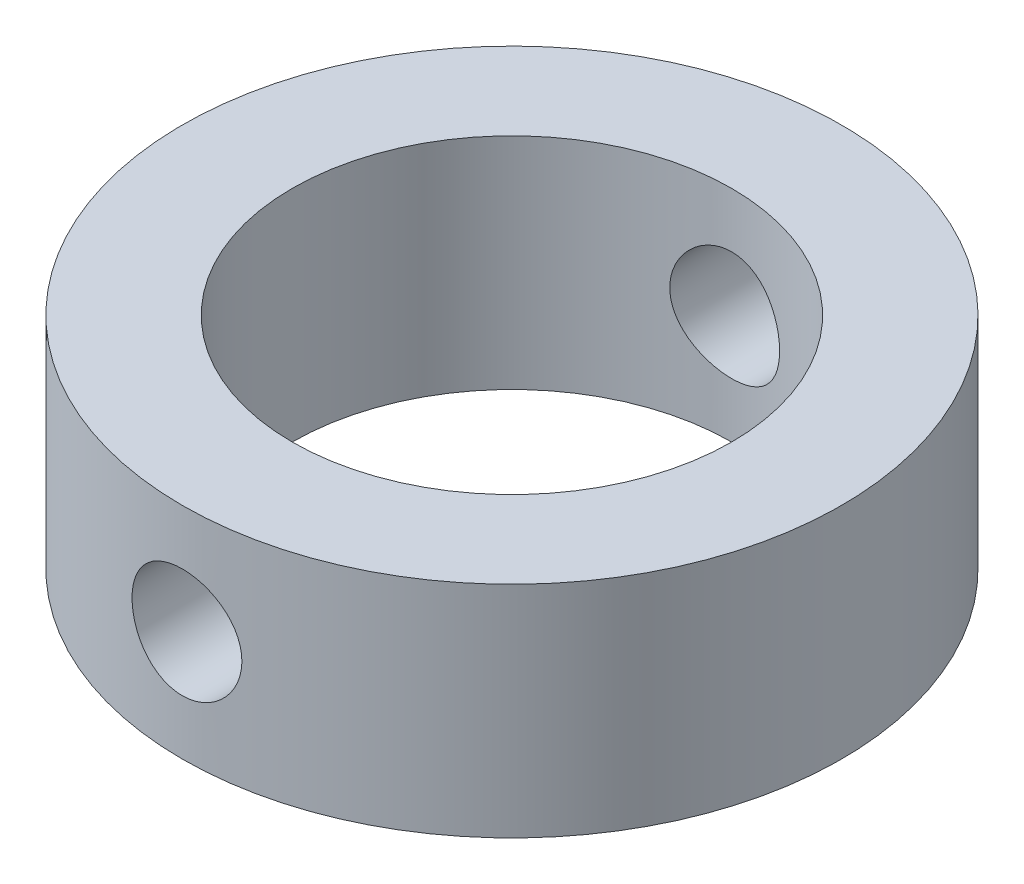
ISO-10303-21;
HEADER;
FILE_DESCRIPTION(('STEP AP214'),'2;1');
FILE_NAME('part.step','',(''),(''),'','','');
FILE_SCHEMA(('AUTOMOTIVE_DESIGN { 1 0 10303 214 1 1 1 1 }'));
ENDSEC;
DATA;
#1=APPLICATION_CONTEXT('core data for automotive mechanical design processes');
#2=APPLICATION_PROTOCOL_DEFINITION('international standard','automotive_design',2000,#1);
#3=PRODUCT_CONTEXT('',#1,'mechanical');
#4=PRODUCT('Part','Part','',(#3));
#5=PRODUCT_RELATED_PRODUCT_CATEGORY('part','',(#4));
#6=PRODUCT_DEFINITION_FORMATION('','',#4);
#7=PRODUCT_DEFINITION_CONTEXT('part definition',#1,'design');
#8=PRODUCT_DEFINITION('design','',#6,#7);
#9=PRODUCT_DEFINITION_SHAPE('','',#8);
#10=(LENGTH_UNIT() NAMED_UNIT(*) SI_UNIT(.MILLI.,.METRE.));
#11=(NAMED_UNIT(*) PLANE_ANGLE_UNIT() SI_UNIT($,.RADIAN.));
#12=(NAMED_UNIT(*) SI_UNIT($,.STERADIAN.) SOLID_ANGLE_UNIT());
#13=UNCERTAINTY_MEASURE_WITH_UNIT(LENGTH_MEASURE(1.E-05),#10,'distance_accuracy_value','');
#14=(GEOMETRIC_REPRESENTATION_CONTEXT(3) GLOBAL_UNCERTAINTY_ASSIGNED_CONTEXT((#13)) GLOBAL_UNIT_ASSIGNED_CONTEXT((#10,
#11,#12)) REPRESENTATION_CONTEXT('',''));
#15=CARTESIAN_POINT('',(0.,0.,0.));
#16=DIRECTION('',(0.,0.,1.));
#17=DIRECTION('',(1.,0.,0.));
#18=AXIS2_PLACEMENT_3D('',#15,#16,#17);
#19=CARTESIAN_POINT('',(0.,8.,0.));
#20=DIRECTION('',(0.,-1.,0.));
#21=DIRECTION('',(0.,0.,-1.));
#22=AXIS2_PLACEMENT_3D('',#19,#20,#21);
#23=CYLINDRICAL_SURFACE('',#22,12.);
#24=CARTESIAN_POINT('',(0.,8.,0.));
#25=DIRECTION('',(0.,1.,0.));
#26=DIRECTION('',(0.,0.,1.));
#27=AXIS2_PLACEMENT_3D('',#24,#25,#26);
#28=CIRCLE('',#27,12.);
#29=CARTESIAN_POINT('',(0.,8.,12.));
#30=VERTEX_POINT('',#29);
#31=EDGE_CURVE('E10',#30,#30,#28,.T.);
#32=ORIENTED_EDGE('',*,*,#31,.F.);
#33=EDGE_LOOP('',(#32));
#34=FACE_BOUND('',#33,.T.);
#35=CARTESIAN_POINT('',(0.,0.,0.));
#36=DIRECTION('',(0.,1.,0.));
#37=DIRECTION('',(0.,0.,1.));
#38=AXIS2_PLACEMENT_3D('',#35,#36,#37);
#39=CIRCLE('',#38,12.);
#40=CARTESIAN_POINT('',(0.,0.,12.));
#41=VERTEX_POINT('',#40);
#42=EDGE_CURVE('E53',#41,#41,#39,.T.);
#43=ORIENTED_EDGE('',*,*,#42,.T.);
#44=EDGE_LOOP('',(#43));
#45=FACE_BOUND('',#44,.T.);
#46=CARTESIAN_POINT('',(-2.,4.,11.8321595661992));
#47=CARTESIAN_POINT('',(-1.99999551873586,3.88849940147055,11.8321615789328));
#48=CARTESIAN_POINT('',(-1.99064413522262,3.77693791514282,11.8337527390819));
#49=CARTESIAN_POINT('',(-1.9535019424531,3.55694516538947,11.8399396576003));
#50=CARTESIAN_POINT('',(-1.92569412824689,3.44851688499355,11.844538186771));
#51=CARTESIAN_POINT('',(-1.8525036349364,3.23800617332671,11.8562048749385));
#52=CARTESIAN_POINT('',(-1.80713564394559,3.1359185210702,11.8632709694721));
#53=CARTESIAN_POINT('',(-1.70014919751157,2.94081523622578,11.8790741768183));
#54=CARTESIAN_POINT('',(-1.63853257080106,2.84779858433813,11.8878111015538));
#55=CARTESIAN_POINT('',(-1.50015002157323,2.67254972020435,11.906067769247));
#56=CARTESIAN_POINT('',(-1.42325523914587,2.59041989489103,11.9155937386236));
#57=CARTESIAN_POINT('',(-1.25677760375622,2.44016535451055,11.9342998453486));
#58=CARTESIAN_POINT('',(-1.16719399931998,2.37204146950767,11.9434799621739));
#59=CARTESIAN_POINT('',(-0.977218295958685,2.25134834622458,11.9605258958617));
#60=CARTESIAN_POINT('',(-0.876764865165367,2.19887439381456,11.9683835394587));
#61=CARTESIAN_POINT('',(-0.668316497379094,2.11158314357556,11.9818298956567));
#62=CARTESIAN_POINT('',(-0.56032205126255,2.0767646976921,11.9874187557813));
#63=CARTESIAN_POINT('',(-0.340914981075393,2.02608597201288,11.9956538777952));
#64=CARTESIAN_POINT('',(-0.229543109343416,2.01005366719625,11.9983268248873));
#65=CARTESIAN_POINT('',(-0.00566022842063738,1.99686739667792,12.0005206347422));
#66=CARTESIAN_POINT('',(0.106850702823119,1.99971214780221,12.0000417117545));
#67=CARTESIAN_POINT('',(0.328641748063101,2.02406508122257,11.9960068674511));
#68=CARTESIAN_POINT('',(0.437942824560113,2.04538813072732,11.9924814695392));
#69=CARTESIAN_POINT('',(0.651393583689433,2.10580085939719,11.9827838301731));
#70=CARTESIAN_POINT('',(0.755543109321203,2.1448910796716,11.9766115081057));
#71=CARTESIAN_POINT('',(0.956284918226118,2.23991251225225,11.9622615880957));
#72=CARTESIAN_POINT('',(1.05284041841524,2.29592000966595,11.954074938615));
#73=CARTESIAN_POINT('',(1.23525242387731,2.42313025810804,11.936605904572));
#74=CARTESIAN_POINT('',(1.3211080623327,2.49433423896865,11.9273234313531));
#75=CARTESIAN_POINT('',(1.48077701875733,2.65094304529545,11.9085621458608));
#76=CARTESIAN_POINT('',(1.55443160180257,2.73650967592079,11.8990823178483));
#77=CARTESIAN_POINT('',(1.68636367075845,2.91886967217266,11.8811036782784));
#78=CARTESIAN_POINT('',(1.74464101482593,3.01566314134626,11.8726048757706));
#79=CARTESIAN_POINT('',(1.84419554759063,3.21791331350198,11.8575500364945));
#80=CARTESIAN_POINT('',(1.88545362182339,3.32337959847367,11.8509961864208));
#81=CARTESIAN_POINT('',(1.94962389665249,3.53987925784604,11.840609509519));
#82=CARTESIAN_POINT('',(1.97253771261436,3.65091214114594,11.8367764431066));
#83=CARTESIAN_POINT('',(1.99914550790341,3.87397292492971,11.8323116753769));
#84=CARTESIAN_POINT('',(2.00306576632995,3.98597310376168,11.8316422860694));
#85=CARTESIAN_POINT('',(1.99217816214597,4.20902933735266,11.8334802782589));
#86=CARTESIAN_POINT('',(1.97737102289973,4.32008542841118,11.8359875370548));
#87=CARTESIAN_POINT('',(1.92964186794248,4.53738220735269,11.8438614996401));
#88=CARTESIAN_POINT('',(1.89683503251711,4.64364891190241,11.8492100153468));
#89=CARTESIAN_POINT('',(1.81415855215382,4.84917613302359,11.862148584044));
#90=CARTESIAN_POINT('',(1.76428788648075,4.94843623004072,11.8697387711246));
#91=CARTESIAN_POINT('',(1.64836533858338,5.13813967552489,11.8863930271791));
#92=CARTESIAN_POINT('',(1.58216845132749,5.22849325820485,11.8954700448028));
#93=CARTESIAN_POINT('',(1.43567157256638,5.396890826156,11.9140373334389));
#94=CARTESIAN_POINT('',(1.35537058910724,5.47493394488779,11.9235276334827));
#95=CARTESIAN_POINT('',(1.18194245626305,5.61732151418296,11.9419713769461));
#96=CARTESIAN_POINT('',(1.08869060270896,5.68151506102763,11.9509182107574));
#97=CARTESIAN_POINT('',(0.892594758359461,5.7933242616039,11.9671608994635));
#98=CARTESIAN_POINT('',(0.789751077976501,5.84094045157908,11.9744568077598));
#99=CARTESIAN_POINT('',(0.577839241201062,5.91800846716389,11.9865468653567));
#100=CARTESIAN_POINT('',(0.468800450082089,5.94753926058794,11.9913518765409));
#101=CARTESIAN_POINT('',(0.247224587899368,5.98785247917106,11.9979646653543));
#102=CARTESIAN_POINT('',(0.134687805457296,5.99863644698588,11.9997726896015));
#103=CARTESIAN_POINT('',(-0.0892330206189422,6.00110550584976,12.0001843031025));
#104=CARTESIAN_POINT('',(-0.200614528482133,5.99302020315287,11.9988264161935));
#105=CARTESIAN_POINT('',(-0.420409579451765,5.95847686218446,11.9931374270987));
#106=CARTESIAN_POINT('',(-0.528823139173985,5.93201892679226,11.9888063415615));
#107=CARTESIAN_POINT('',(-0.73951715673483,5.86156946756508,11.9776559106192));
#108=CARTESIAN_POINT('',(-0.841804297723056,5.81759746543196,11.970839336327));
#109=CARTESIAN_POINT('',(-1.03758436238573,5.71339365101553,11.9554620550242));
#110=CARTESIAN_POINT('',(-1.13107686889458,5.65316106795004,11.9469012653393));
#111=CARTESIAN_POINT('',(-1.30777035642112,5.5173319260316,11.9288610369313));
#112=CARTESIAN_POINT('',(-1.3908411444822,5.44156723619899,11.919372196329));
#113=CARTESIAN_POINT('',(-1.54317110076073,5.27717735367695,11.900610426515));
#114=CARTESIAN_POINT('',(-1.61242702936952,5.18854915286997,11.8913375483961));
#115=CARTESIAN_POINT('',(-1.73561141672869,5.00020374200831,11.8739867482713));
#116=CARTESIAN_POINT('',(-1.78942799124616,4.90041252818761,11.8659177427663));
#117=CARTESIAN_POINT('',(-1.87945162912342,4.69311261132948,11.8519936807305));
#118=CARTESIAN_POINT('',(-1.91567628417846,4.58561174185811,11.846136413799));
#119=CARTESIAN_POINT('',(-1.96162084250194,4.39807698441009,11.8385979588519));
#120=CARTESIAN_POINT('',(-1.97598993413711,4.31917855362991,11.8361969873557));
#121=CARTESIAN_POINT('',(-1.99518103614505,4.16019721213045,11.8329770823046));
#122=CARTESIAN_POINT('',(-2.00000321983422,4.08011432294064,11.8321581200295));
#123=CARTESIAN_POINT('',(-2.,4.,11.8321595661992));
#124=B_SPLINE_CURVE_WITH_KNOTS('',3,(#46,#47,#48,#49,#50,#51,#52,#53,#54,#55,#56,#57,#58,#59,
#60,#61,#62,#63,#64,#65,#66,#67,#68,#69,#70,#71,#72,#73,#74,#75,#76,#77,#78,#79,#80,#81,#82,#83,
#84,#85,#86,#87,#88,#89,#90,#91,#92,#93,#94,#95,#96,#97,#98,#99,#100,#101,#102,#103,#104,#105,
#106,#107,#108,#109,#110,#111,#112,#113,#114,#115,#116,#117,#118,#119,#120,#121,#122,#123),
.UNSPECIFIED.,.T.,.F.,(4,2,2,2,2,2,2,2,2,2,2,2,2,2,2,2,2,2,2,2,2,2,2,2,2,2,2,2,2,2,2,2,2,2,2,2,
2,2,4),(0.,0.334208831142192,0.668726015970376,1.00296399830015,1.33716437924219,
1.67431327324572,2.01148214267558,2.35066384089148,2.6898234808889,3.02585253978052,
3.36185875722154,3.69453696931735,4.02722531399626,4.3614368331154,4.69567540981411,
5.03396898769699,5.37226568596815,5.71094129998883,6.04958708750461,6.38418833936328,
6.71877666731181,7.05124851708393,7.38374025834859,7.71929874210161,8.05488083544551,
8.39395290428305,8.73301400381358,9.07058387534117,9.40812596729881,9.74158221012733,
10.0750365857506,10.4081203186597,10.7412198431387,11.078135979706,11.4151310310545,
11.7545098209466,12.0935485339556,12.3336853643501,12.5738178352145),.UNSPECIFIED.);
#125=CARTESIAN_POINT('',(-2.,4.,11.8321595661992));
#126=VERTEX_POINT('',#125);
#127=EDGE_CURVE('E83',#126,#126,#124,.T.);
#128=ORIENTED_EDGE('',*,*,#127,.F.);
#129=EDGE_LOOP('',(#128));
#130=FACE_BOUND('',#129,.T.);
#131=CARTESIAN_POINT('',(0.,6.,-12.));
#132=CARTESIAN_POINT('',(0.111512723966572,5.99999552884175,-11.9999980893506));
#133=CARTESIAN_POINT('',(0.223086305471057,5.99064218002486,-11.9984294233043));
#134=CARTESIAN_POINT('',(0.443104177338434,5.95349147298774,-11.9923227595311));
#135=CARTESIAN_POINT('',(0.551545494367397,5.92567715447072,-11.9877820313911));
#136=CARTESIAN_POINT('',(0.762083797770115,5.8524676411258,-11.9762405458916));
#137=CARTESIAN_POINT('',(0.86418589474552,5.80708682748754,-11.9692418012735));
#138=CARTESIAN_POINT('',(1.05931347358235,5.70007016635808,-11.9535538166566));
#139=CARTESIAN_POINT('',(1.15233999190287,5.6384361780136,-11.9448647700355));
#140=CARTESIAN_POINT('',(1.32757809143334,5.50003593294363,-11.9266665396665));
#141=CARTESIAN_POINT('',(1.40969032282797,5.4231447082911,-11.9171509745189));
#142=CARTESIAN_POINT('',(1.55991079892794,5.25668162522175,-11.8984210150139));
#143=CARTESIAN_POINT('',(1.62801815951278,5.16710896683471,-11.8892066397013));
#144=CARTESIAN_POINT('',(1.74869370048411,4.97714322704236,-11.8720605260782));
#145=CARTESIAN_POINT('',(1.8011636422888,4.8766869305562,-11.8641370327331));
#146=CARTESIAN_POINT('',(1.88844669232898,4.6682323485595,-11.8505583183574));
#147=CARTESIAN_POINT('',(1.92326099325249,4.56023457305789,-11.8449029441145));
#148=CARTESIAN_POINT('',(1.97393150222785,4.34081578011477,-11.836564294742));
#149=CARTESIAN_POINT('',(1.98995922330832,4.22943541079889,-11.8338541478856));
#150=CARTESIAN_POINT('',(2.0031333802319,4.00553577849322,-11.8316315114932));
#151=CARTESIAN_POINT('',(2.0002811523112,3.89301659666616,-11.8321187956577));
#152=CARTESIAN_POINT('',(1.97591607871692,3.67125771097964,-11.8362114309084));
#153=CARTESIAN_POINT('',(1.95459590551182,3.56199615716381,-11.8397845865513));
#154=CARTESIAN_POINT('',(1.89420251232276,3.34862294573669,-11.8495959616881));
#155=CARTESIAN_POINT('',(1.85512868345579,3.24451146488916,-11.8558342725862));
#156=CARTESIAN_POINT('',(1.76014179687513,3.04381694124727,-11.8703078346728));
#157=CARTESIAN_POINT('',(1.70414873110377,2.94727247513502,-11.8785525368586));
#158=CARTESIAN_POINT('',(1.57696961404595,2.76487647956929,-11.8961033473201));
#159=CARTESIAN_POINT('',(1.50578233652343,2.67902581403606,-11.9054095412343));
#160=CARTESIAN_POINT('',(1.34918576972724,2.51933913135412,-11.9241762230383));
#161=CARTESIAN_POINT('',(1.2636111710985,2.44566518516794,-11.9336371938532));
#162=CARTESIAN_POINT('',(1.08122819918532,2.31369778986773,-11.9515408111738));
#163=CARTESIAN_POINT('',(0.984419753525138,2.25540443985342,-11.959983451118));
#164=CARTESIAN_POINT('',(0.782164732933369,2.15583821829097,-11.9749111431433));
#165=CARTESIAN_POINT('',(0.676710980451729,2.114579664535,-11.9813945472596));
#166=CARTESIAN_POINT('',(0.460238676482185,2.05040462780322,-11.9916600241013));
#167=CARTESIAN_POINT('',(0.349220591343575,2.02748661042103,-11.9954423228038));
#168=CARTESIAN_POINT('',(0.1261679210413,2.00086291323109,-11.9998490387415));
#169=CARTESIAN_POINT('',(0.0141605897208097,1.99693474255551,-12.0005100241023));
#170=CARTESIAN_POINT('',(-0.208911818311909,2.0078090755425,-11.9986997953694));
#171=CARTESIAN_POINT('',(-0.31997693111363,2.02261085850699,-11.9962287017929));
#172=CARTESIAN_POINT('',(-0.53732494043741,2.07033987946838,-11.9884546155056));
#173=CARTESIAN_POINT('',(-0.643632694708302,2.1031569667121,-11.9831688384105));
#174=CARTESIAN_POINT('',(-0.849237507888353,2.18586761455963,-11.9703557156429));
#175=CARTESIAN_POINT('',(-0.948534172727774,2.23576213410822,-11.9628282440962));
#176=CARTESIAN_POINT('',(-1.13826455157517,2.35172089975743,-11.9462761304193));
#177=CARTESIAN_POINT('',(-1.22861220074972,2.4179241249338,-11.9372388470962));
#178=CARTESIAN_POINT('',(-1.39699486840215,2.56442985230805,-11.9187077391352));
#179=CARTESIAN_POINT('',(-1.47502899175727,2.64473337862133,-11.9092138813724));
#180=CARTESIAN_POINT('',(-1.6173942237264,2.81815803845714,-11.8907214018868));
#181=CARTESIAN_POINT('',(-1.68157500889097,2.91140333241153,-11.8817289290968));
#182=CARTESIAN_POINT('',(-1.79336184823599,3.10748237531083,-11.8653722382231));
#183=CARTESIAN_POINT('',(-1.84096842781586,3.210315820182,-11.8580079685282));
#184=CARTESIAN_POINT('',(-1.91803066517852,3.42223178624971,-11.8457876295816));
#185=CARTESIAN_POINT('',(-1.94756114603836,3.53128647602439,-11.8409212344885));
#186=CARTESIAN_POINT('',(-1.98786836302262,3.75289610337741,-11.8342217346821));
#187=CARTESIAN_POINT('',(-1.99864672955693,3.86545073578564,-11.8323883662618));
#188=CARTESIAN_POINT('',(-2.00109829283788,4.08936413276993,-11.8319738646721));
#189=CARTESIAN_POINT('',(-1.99300810890015,4.20072030286023,-11.8333524520452));
#190=CARTESIAN_POINT('',(-1.95846387116548,4.42046339844061,-11.8391182516298));
#191=CARTESIAN_POINT('',(-1.93200987688998,4.5288503335535,-11.8435054540897));
#192=CARTESIAN_POINT('',(-1.86157959167592,4.73948674983409,-11.8547788502538));
#193=CARTESIAN_POINT('',(-1.81762367248035,4.84174320804482,-11.8616621377574));
#194=CARTESIAN_POINT('',(-1.71346160313273,5.03746853535588,-11.8771549513777));
#195=CARTESIAN_POINT('',(-1.65325464699885,5.13093696829771,-11.8857645631072));
#196=CARTESIAN_POINT('',(-1.51745510749772,5.3076284664862,-11.903867632365));
#197=CARTESIAN_POINT('',(-1.44168845087492,5.39071681336022,-11.9133703646104));
#198=CARTESIAN_POINT('',(-1.27728722510418,5.54308128357995,-11.9321149788867));
#199=CARTESIAN_POINT('',(-1.18864969033011,5.61235421491054,-11.9413568002124));
#200=CARTESIAN_POINT('',(-1.00029533571223,5.73555861455996,-11.9586122371378));
#201=CARTESIAN_POINT('',(-0.900506230026255,5.78938083145036,-11.9666169300248));
#202=CARTESIAN_POINT('',(-0.693210455503186,5.87941558768794,-11.9804093408142));
#203=CARTESIAN_POINT('',(-0.585711595864009,5.91564566486376,-11.9861992654199));
#204=CARTESIAN_POINT('',(-0.398162648036322,5.96160421930133,-11.9936463266636));
#205=CARTESIAN_POINT('',(-0.319247064238759,5.97597957569277,-11.9960162181869));
#206=CARTESIAN_POINT('',(-0.160231448255848,5.9951789902758,-11.999193727889));
#207=CARTESIAN_POINT('',(-0.0801314364867958,6.00000321290989,-12.0000013729651));
#208=CARTESIAN_POINT('',(0.,6.,-12.));
#209=B_SPLINE_CURVE_WITH_KNOTS('',3,(#131,#132,#133,#134,#135,#136,#137,#138,#139,#140,#141,
#142,#143,#144,#145,#146,#147,#148,#149,#150,#151,#152,#153,#154,#155,#156,#157,#158,#159,#160,
#161,#162,#163,#164,#165,#166,#167,#168,#169,#170,#171,#172,#173,#174,#175,#176,#177,#178,#179,
#180,#181,#182,#183,#184,#185,#186,#187,#188,#189,#190,#191,#192,#193,#194,#195,#196,#197,#198,
#199,#200,#201,#202,#203,#204,#205,#206,#207,#208),.UNSPECIFIED.,.T.,.F.,(4,2,2,2,2,2,2,2,2,2,2,
2,2,2,2,2,2,2,2,2,2,2,2,2,2,2,2,2,2,2,2,2,2,2,2,2,2,2,4),(0.,0.334245267950808,
0.668798036556336,1.00307749362022,1.33731873013983,1.67441992849866,2.01154240135885,
2.35074016659072,2.68991501500945,3.02596861682739,3.36199843456709,3.69456417408327,
4.02714132020305,4.36131645306046,4.69551856544459,5.03386215929061,5.37220793308678,
5.71083751132723,6.04943875616919,6.38406306793118,6.71867450428688,7.05126245605132,
7.38386908660853,7.71941460501619,8.05498450443426,8.39403057606095,8.73306589900754,
9.07068817873418,9.40828110229294,9.7416632761816,10.0750443695051,10.4080385458098,
10.7410492402347,11.0780110735471,11.4150506710318,11.7544178528576,12.0934460170406,
12.3336339853121,12.5738178182157),.UNSPECIFIED.);
#210=CARTESIAN_POINT('',(0.,6.,-12.));
#211=VERTEX_POINT('',#210);
#212=EDGE_CURVE('E89',#211,#211,#209,.T.);
#213=ORIENTED_EDGE('',*,*,#212,.F.);
#214=EDGE_LOOP('',(#213));
#215=FACE_BOUND('',#214,.T.);
#216=ADVANCED_FACE('F39',(#34,#45,#130,#215),#23,.T.);
#217=CARTESIAN_POINT('',(0.,8.,0.));
#218=DIRECTION('',(0.,-1.,0.));
#219=DIRECTION('',(0.,0.,-1.));
#220=AXIS2_PLACEMENT_3D('',#217,#218,#219);
#221=CYLINDRICAL_SURFACE('',#220,8.);
#222=CARTESIAN_POINT('',(-2.,4.,7.74596669241483));
#223=CARTESIAN_POINT('',(-1.99999686287446,3.88955939925874,7.74596880070288));
#224=CARTESIAN_POINT('',(-1.99082099639812,3.77908408105718,7.74835444811678));
#225=CARTESIAN_POINT('',(-1.95441850037103,3.56130593746119,7.75761489594051));
#226=CARTESIAN_POINT('',(-1.92718136539368,3.45400499642545,7.76449230897304));
#227=CARTESIAN_POINT('',(-1.85559295970563,3.24575716945026,7.7819097967692));
#228=CARTESIAN_POINT('',(-1.81126378228359,3.14480227569143,7.79244514152366));
#229=CARTESIAN_POINT('',(-1.70681691300911,2.95175131796809,7.81598553623007));
#230=CARTESIAN_POINT('',(-1.64669855084855,2.85965563033583,7.82899069102791));
#231=CARTESIAN_POINT('',(-1.51096674184951,2.68491068379023,7.856325730845));
#232=CARTESIAN_POINT('',(-1.43506951016324,2.60248511971996,7.87067678098427));
#233=CARTESIAN_POINT('',(-1.27054565128053,2.45139088451173,7.89890300412235));
#234=CARTESIAN_POINT('',(-1.18191783534425,2.3827234995026,7.91277813253111));
#235=CARTESIAN_POINT('',(-0.992916160863164,2.26017962589498,7.93872332416466));
#236=CARTESIAN_POINT('',(-0.892395660956097,2.20652288947083,7.95076549920474));
#237=CARTESIAN_POINT('',(-0.683410547434211,2.11695228467753,7.97144649540787));
#238=CARTESIAN_POINT('',(-0.574947108633553,2.08103579846759,7.98008581867475));
#239=CARTESIAN_POINT('',(-0.35548700700333,2.02868173233713,7.99283807078544));
#240=CARTESIAN_POINT('',(-0.244586175639181,2.01186428453873,7.99703915075451));
#241=CARTESIAN_POINT('',(-0.0214630554102164,1.99699329657956,8.00074875285838));
#242=CARTESIAN_POINT('',(0.0907590356304539,1.99893698223232,8.00025796877363));
#243=CARTESIAN_POINT('',(0.310704494344774,2.02125988020012,7.99470475962828));
#244=CARTESIAN_POINT('',(0.418472431202133,2.04122906004309,7.98974401872699));
#245=CARTESIAN_POINT('',(0.629076494827372,2.0983770160388,7.97592669219883));
#246=CARTESIAN_POINT('',(0.731912358740875,2.13555670830193,7.96706989918753));
#247=CARTESIAN_POINT('',(0.930813407003612,2.22640205654965,7.94630007760717));
#248=CARTESIAN_POINT('',(1.02680901953301,2.2802136357294,7.93436015756043));
#249=CARTESIAN_POINT('',(1.20855124468098,2.40268454329301,7.90871923047719));
#250=CARTESIAN_POINT('',(1.29429607017101,2.47134645484849,7.89501791721992));
#251=CARTESIAN_POINT('',(1.45554807016991,2.6237669935859,7.86690971015616));
#252=CARTESIAN_POINT('',(1.5307153581504,2.70788391387822,7.85249375620734));
#253=CARTESIAN_POINT('',(1.66595275192604,2.8876799788322,7.82492034813365));
#254=CARTESIAN_POINT('',(1.72602215209203,2.9833596635928,7.81176295284776));
#255=CARTESIAN_POINT('',(1.8295762580452,3.18423202731917,7.78816397465319));
#256=CARTESIAN_POINT('',(1.87297913394098,3.28946858425056,7.77773586980577));
#257=CARTESIAN_POINT('',(1.94137124127268,3.50606837446116,7.76094912111966));
#258=CARTESIAN_POINT('',(1.96636441310582,3.61743029118651,7.75458960648175));
#259=CARTESIAN_POINT('',(1.99666371093214,3.8399676012185,7.74684284831313));
#260=CARTESIAN_POINT('',(2.0024723791357,3.9510702346637,7.74532871274919));
#261=CARTESIAN_POINT('',(1.99561359241244,4.17265754926253,7.74709874784831));
#262=CARTESIAN_POINT('',(1.98294783827904,4.28314228636099,7.75038247681013));
#263=CARTESIAN_POINT('',(1.93994037115013,4.49849141196376,7.76125665563648));
#264=CARTESIAN_POINT('',(1.9098912546254,4.60341818125667,7.768775761875));
#265=CARTESIAN_POINT('',(1.8332944653365,4.80674516628135,7.7872057461677));
#266=CARTESIAN_POINT('',(1.78674483817004,4.90514460724427,7.79811702598891));
#267=CARTESIAN_POINT('',(1.67741653434925,5.09475302229388,7.8223690967461));
#268=CARTESIAN_POINT('',(1.6143374030685,5.18578307203448,7.83575334885313));
#269=CARTESIAN_POINT('',(1.47412058586891,5.35615069024108,7.86333666457373));
#270=CARTESIAN_POINT('',(1.39698058961088,5.43548633332006,7.87753586182776));
#271=CARTESIAN_POINT('',(1.22852544196945,5.58224883405676,7.90557922425285));
#272=CARTESIAN_POINT('',(1.13690390506319,5.64932805003905,7.91940561649468));
#273=CARTESIAN_POINT('',(0.943405365389351,5.76714869356099,7.94477773290987));
#274=CARTESIAN_POINT('',(0.841528897915183,5.81789097328656,7.95632357603169));
#275=CARTESIAN_POINT('',(0.631116403462182,5.90115682762235,7.9757609259065));
#276=CARTESIAN_POINT('',(0.522634762055765,5.93381142750325,7.98367864017925));
#277=CARTESIAN_POINT('',(0.301499520637615,5.98036826768673,7.99508234716634));
#278=CARTESIAN_POINT('',(0.188846730082482,5.99427412699123,7.99856919514738));
#279=CARTESIAN_POINT('',(-0.0341670528866453,6.00273517915108,8.00068338817612));
#280=CARTESIAN_POINT('',(-0.144507653932042,5.99780341819082,7.99943957759977));
#281=CARTESIAN_POINT('',(-0.3627349928295,5.9699043454113,7.99251792914887));
#282=CARTESIAN_POINT('',(-0.470621803561856,5.94693756997366,7.98684022314338));
#283=CARTESIAN_POINT('',(-0.680342071289547,5.88389556045828,7.97170865707778));
#284=CARTESIAN_POINT('',(-0.782204989161725,5.84391309337124,7.96227529004785));
#285=CARTESIAN_POINT('',(-0.977834106083248,5.74805884196086,7.94062577827316));
#286=CARTESIAN_POINT('',(-1.07159928253127,5.69218505465903,7.92840928277515));
#287=CARTESIAN_POINT('',(-1.25080385684661,5.56456953200773,7.90214499360574));
#288=CARTESIAN_POINT('',(-1.33598997659667,5.49247971419234,7.88806033883329));
#289=CARTESIAN_POINT('',(-1.49323004054701,5.33515429604531,7.85981298114379));
#290=CARTESIAN_POINT('',(-1.56528065015318,5.24991536777768,7.84565025934604));
#291=CARTESIAN_POINT('',(-1.69552405294366,5.06679717162108,7.81854951691005));
#292=CARTESIAN_POINT('',(-1.75343323883276,4.96871175326949,7.80563927346578));
#293=CARTESIAN_POINT('',(-1.85185379317094,4.76388902025036,7.78287910989656));
#294=CARTESIAN_POINT('',(-1.8923778195043,4.65715806781231,7.77302696466427));
#295=CARTESIAN_POINT('',(-1.94884505714201,4.45884597632968,7.75903817501475));
#296=CARTESIAN_POINT('',(-1.96798634119376,4.36821367122773,7.75417326006998));
#297=CARTESIAN_POINT('',(-1.99356458514354,4.18506226200462,7.7476367716524));
#298=CARTESIAN_POINT('',(-2.0000026287435,4.0925433195112,7.74596492578215));
#299=CARTESIAN_POINT('',(-2.,4.,7.74596669241483));
#300=B_SPLINE_CURVE_WITH_KNOTS('',3,(#222,#223,#224,#225,#226,#227,#228,#229,#230,#231,#232,
#233,#234,#235,#236,#237,#238,#239,#240,#241,#242,#243,#244,#245,#246,#247,#248,#249,#250,#251,
#252,#253,#254,#255,#256,#257,#258,#259,#260,#261,#262,#263,#264,#265,#266,#267,#268,#269,#270,
#271,#272,#273,#274,#275,#276,#277,#278,#279,#280,#281,#282,#283,#284,#285,#286,#287,#288,#289,
#290,#291,#292,#293,#294,#295,#296,#297,#298,#299),.UNSPECIFIED.,.T.,.F.,(4,2,2,2,2,2,2,2,2,2,2,
2,2,2,2,2,2,2,2,2,2,2,2,2,2,2,2,2,2,2,2,2,2,2,2,2,2,2,4),(0.,0.330981953388909,
0.662156593142932,0.992904581732816,1.32366661404383,1.66099163354381,1.99834817183893,
2.34041197118336,2.68242527877674,3.01751000796277,3.35254518932816,3.68014610151158,
4.00776445379829,4.33834299403556,4.6689790837513,5.00856373257529,5.34816424959842,
5.68941145606722,6.03058560103638,6.36274859809374,6.69488101747041,7.02157924007365,
7.34831617137134,7.68146276687326,8.01466415108036,8.35620264772255,8.69772332575642,
9.03673658245543,9.3756843912723,9.70546756901965,10.0352409390158,10.3632390124777,
10.6912784459046,11.0271767726566,11.3631602525241,11.7054118182895,12.0474137709606,
12.3247826174462,12.6021278008238),.UNSPECIFIED.);
#301=CARTESIAN_POINT('',(-2.,4.,7.74596669241483));
#302=VERTEX_POINT('',#301);
#303=EDGE_CURVE('E64',#302,#302,#300,.T.);
#304=ORIENTED_EDGE('',*,*,#303,.T.);
#305=EDGE_LOOP('',(#304));
#306=FACE_BOUND('',#305,.T.);
#307=CARTESIAN_POINT('',(0.,8.,0.));
#308=DIRECTION('',(0.,1.,0.));
#309=DIRECTION('',(0.,0.,1.));
#310=AXIS2_PLACEMENT_3D('',#307,#308,#309);
#311=CIRCLE('',#310,8.);
#312=CARTESIAN_POINT('',(0.,8.,8.));
#313=VERTEX_POINT('',#312);
#314=EDGE_CURVE('E59',#313,#313,#311,.T.);
#315=ORIENTED_EDGE('',*,*,#314,.T.);
#316=EDGE_LOOP('',(#315));
#317=FACE_BOUND('',#316,.T.);
#318=CARTESIAN_POINT('',(0.,0.,0.));
#319=DIRECTION('',(0.,1.,0.));
#320=DIRECTION('',(0.,0.,1.));
#321=AXIS2_PLACEMENT_3D('',#318,#319,#320);
#322=CIRCLE('',#321,8.);
#323=CARTESIAN_POINT('',(0.,0.,8.));
#324=VERTEX_POINT('',#323);
#325=EDGE_CURVE('E62',#324,#324,#322,.T.);
#326=ORIENTED_EDGE('',*,*,#325,.F.);
#327=EDGE_LOOP('',(#326));
#328=FACE_BOUND('',#327,.T.);
#329=CARTESIAN_POINT('',(0.,6.,-8.));
#330=CARTESIAN_POINT('',(0.110501451559641,5.99999689901579,-7.9999981315735));
#331=CARTESIAN_POINT('',(0.221037543774351,5.99081126563495,-7.99768770842435));
#332=CARTESIAN_POINT('',(0.438941765027377,5.95436646492399,-7.98869485106526));
#333=CARTESIAN_POINT('',(0.546308062494319,5.92709705394953,-7.98200993893301));
#334=CARTESIAN_POINT('',(0.754694496243435,5.85541432871722,-7.96500835109376));
#335=CARTESIAN_POINT('',(0.855722084573335,5.81102160171297,-7.95469603789411));
#336=CARTESIAN_POINT('',(1.04889617587257,5.70642481327354,-7.93153791743495));
#337=CARTESIAN_POINT('',(1.14104237913168,5.64622021850804,-7.91869202472209));
#338=CARTESIAN_POINT('',(1.31573590306789,5.51039894712776,-7.89156551455591));
#339=CARTESIAN_POINT('',(1.39807425341474,5.43451790005459,-7.87726276197502));
#340=CARTESIAN_POINT('',(1.54899856960443,5.27006372678795,-7.84898160157248));
#341=CARTESIAN_POINT('',(1.61758298259892,5.18148916940409,-7.83500323053157));
#342=CARTESIAN_POINT('',(1.74003539039863,4.99253969768401,-7.80873034264225));
#343=CARTESIAN_POINT('',(1.79366962123352,4.89200902558836,-7.79646392619748));
#344=CARTESIAN_POINT('',(1.88319587806766,4.68300211778662,-7.77532659757355));
#345=CARTESIAN_POINT('',(1.91909074058685,4.57452715555731,-7.76645514259225));
#346=CARTESIAN_POINT('',(1.97140644907302,4.35500866906445,-7.7533396892843));
#347=CARTESIAN_POINT('',(1.98820302444274,4.24406013861601,-7.74900654662681));
#348=CARTESIAN_POINT('',(2.00301570008854,4.02084190800087,-7.74519149946122));
#349=CARTESIAN_POINT('',(2.00103485575748,3.90857242574382,-7.74570880570571));
#350=CARTESIAN_POINT('',(1.97864869951961,3.6887789230062,-7.75145607355756));
#351=CARTESIAN_POINT('',(1.95869112025418,3.58120583804623,-7.75657150676391));
#352=CARTESIAN_POINT('',(1.90163224920399,3.37098526545192,-7.77075612894758));
#353=CARTESIAN_POINT('',(1.86452973609252,3.26833812929477,-7.77982559958985));
#354=CARTESIAN_POINT('',(1.77385263724958,3.06968264499716,-7.80100151874212));
#355=CARTESIAN_POINT('',(1.72011555631056,2.97375177094724,-7.81313769959755));
#356=CARTESIAN_POINT('',(1.59780836801993,2.79210838699091,-7.83906281127988));
#357=CARTESIAN_POINT('',(1.52923566507845,2.70639766924367,-7.85285203112837));
#358=CARTESIAN_POINT('',(1.37688456624163,2.5450618457408,-7.88101174053188));
#359=CARTESIAN_POINT('',(1.29272834422115,2.46979401325153,-7.89538759304001));
#360=CARTESIAN_POINT('',(1.11281589000493,2.3343716767148,-7.92274620771675));
#361=CARTESIAN_POINT('',(1.01705930361059,2.27421763431525,-7.93572892732543));
#362=CARTESIAN_POINT('',(0.816154518241856,2.17059921836749,-7.9589030945892));
#363=CARTESIAN_POINT('',(0.710975190944832,2.12719287966076,-7.96908480170303));
#364=CARTESIAN_POINT('',(0.494501344190511,2.05877692572057,-7.98543889321888));
#365=CARTESIAN_POINT('',(0.383207998867313,2.03376379144248,-7.99161204452374));
#366=CARTESIAN_POINT('',(0.160719960520036,2.00338991258822,-7.999139990285));
#367=CARTESIAN_POINT('',(0.0495956266509469,1.9975426318996,-8.00061404677705));
#368=CARTESIAN_POINT('',(-0.172043833068677,2.00433200274065,-7.99891739752601));
#369=CARTESIAN_POINT('',(-0.282559012859459,2.01696699039884,-7.99574710989128));
#370=CARTESIAN_POINT('',(-0.498152358368655,2.05996121118851,-7.98519441503143));
#371=CARTESIAN_POINT('',(-0.603286825291672,2.09005501796932,-7.97787512247748));
#372=CARTESIAN_POINT('',(-0.807009723270015,2.16680944537126,-7.95984942178845));
#373=CARTESIAN_POINT('',(-0.905597492043512,2.21347173908423,-7.94914267159856));
#374=CARTESIAN_POINT('',(-1.0953641792398,2.3229815051663,-7.92524410568414));
#375=CARTESIAN_POINT('',(-1.18638058911444,2.38610148319568,-7.91201156489243));
#376=CARTESIAN_POINT('',(-1.35670215152433,2.52638654506263,-7.88459345583226));
#377=CARTESIAN_POINT('',(-1.43600527863068,2.60355405282254,-7.87040772335606));
#378=CARTESIAN_POINT('',(-1.58265409076364,2.77200261445929,-7.84225275947695));
#379=CARTESIAN_POINT('',(-1.64965849016271,2.86358360400323,-7.82829738916375));
#380=CARTESIAN_POINT('',(-1.7673476786836,3.05697684595429,-7.80257171169652));
#381=CARTESIAN_POINT('',(-1.81803319221058,3.15878864394634,-7.79080130756035));
#382=CARTESIAN_POINT('',(-1.90126856081239,3.3692076298841,-7.77090792979554));
#383=CARTESIAN_POINT('',(-1.93392586220542,3.47777017112534,-7.76276340389207));
#384=CARTESIAN_POINT('',(-1.98046087993837,3.69907951718548,-7.75102325453578));
#385=CARTESIAN_POINT('',(-1.99434270330488,3.81182540137665,-7.74742663626581));
#386=CARTESIAN_POINT('',(-2.00271812044533,4.03482803180694,-7.74526534938609));
#387=CARTESIAN_POINT('',(-1.99775719704016,4.14506324683297,-7.74655910304352));
#388=CARTESIAN_POINT('',(-1.96983637108382,4.36307185155731,-7.7537054534379));
#389=CARTESIAN_POINT('',(-1.94687683024903,4.47084529068487,-7.75955795855809));
#390=CARTESIAN_POINT('',(-1.88390842592373,4.68027794542054,-7.77508347576963));
#391=CARTESIAN_POINT('',(-1.84400187290717,4.78196974032028,-7.78473353648412));
#392=CARTESIAN_POINT('',(-1.7483532181401,4.97728717695158,-7.80677007633105));
#393=CARTESIAN_POINT('',(-1.69260892004559,5.07091169758255,-7.81915693494364));
#394=CARTESIAN_POINT('',(-1.56515699818285,5.25007283866936,-7.84567512351349));
#395=CARTESIAN_POINT('',(-1.49307088388301,5.33533476456528,-7.85984353109009));
#396=CARTESIAN_POINT('',(-1.33571916158631,5.49272939306054,-7.88810702995047));
#397=CARTESIAN_POINT('',(-1.25045042834819,5.56485897348396,-7.90220210302746));
#398=CARTESIAN_POINT('',(-1.06729011560345,5.69521507808614,-7.92903540863551));
#399=CARTESIAN_POINT('',(-0.969197896421849,5.75316615156211,-7.94174444487824));
#400=CARTESIAN_POINT('',(-0.764354746013969,5.85166328392071,-7.96406566633491));
#401=CARTESIAN_POINT('',(-0.65761008458232,5.89222181419805,-7.97368006933042));
#402=CARTESIAN_POINT('',(-0.459213670991296,5.94876244043954,-7.98730746087389));
#403=CARTESIAN_POINT('',(-0.368506894544091,5.96793499073791,-7.9920344673692));
#404=CARTESIAN_POINT('',(-0.185208095381711,5.99355459149592,-7.99838140309264));
#405=CARTESIAN_POINT('',(-0.0926162149901548,6.00000259907373,-8.00000156601192));
#406=CARTESIAN_POINT('',(0.,6.,-8.));
#407=B_SPLINE_CURVE_WITH_KNOTS('',3,(#329,#330,#331,#332,#333,#334,#335,#336,#337,#338,#339,
#340,#341,#342,#343,#344,#345,#346,#347,#348,#349,#350,#351,#352,#353,#354,#355,#356,#357,#358,
#359,#360,#361,#362,#363,#364,#365,#366,#367,#368,#369,#370,#371,#372,#373,#374,#375,#376,#377,
#378,#379,#380,#381,#382,#383,#384,#385,#386,#387,#388,#389,#390,#391,#392,#393,#394,#395,#396,
#397,#398,#399,#400,#401,#402,#403,#404,#405,#406),.UNSPECIFIED.,.T.,.F.,(4,2,2,2,2,2,2,2,2,2,2,
2,2,2,2,2,2,2,2,2,2,2,2,2,2,2,2,2,2,2,2,2,2,2,2,2,2,2,4),(0.,0.33116494996252,0.662517650351866,
0.99347320304814,1.32443992022577,1.66152580582852,1.99864972773416,2.34078196727742,
2.68285948225824,3.01808393468093,3.3532538415469,3.68029996013785,4.00736937959145,
4.337740371696,4.66816921119311,5.00802001296453,5.34788119415424,5.6889097201658,
6.02987298255951,6.36211078603462,6.69431868154751,7.02160366023144,7.34892169767481,
7.68204783424897,8.01523150681786,8.35659345610395,8.69794025003772,9.03723006156476,
9.37644564340971,9.70591707202577,10.0353818794581,10.3628853408369,10.6904342418696,
11.0265276855097,11.3627009303165,11.7049624733721,12.0469781843289,12.3245632392729,
12.6021274139515),.UNSPECIFIED.);
#408=CARTESIAN_POINT('',(0.,6.,-8.));
#409=VERTEX_POINT('',#408);
#410=EDGE_CURVE('E43',#409,#409,#407,.T.);
#411=ORIENTED_EDGE('',*,*,#410,.T.);
#412=EDGE_LOOP('',(#411));
#413=FACE_BOUND('',#412,.T.);
#414=ADVANCED_FACE('F70',(#306,#317,#328,#413),#221,.F.);
#415=CARTESIAN_POINT('',(0.,8.,0.));
#416=DIRECTION('',(0.,1.,0.));
#417=DIRECTION('',(0.,0.,1.));
#418=AXIS2_PLACEMENT_3D('',#415,#416,#417);
#419=PLANE('',#418);
#420=ORIENTED_EDGE('',*,*,#31,.T.);
#421=EDGE_LOOP('',(#420));
#422=FACE_BOUND('',#421,.T.);
#423=ORIENTED_EDGE('',*,*,#314,.F.);
#424=EDGE_LOOP('',(#423));
#425=FACE_BOUND('',#424,.T.);
#426=ADVANCED_FACE('F107',(#422,#425),#419,.T.);
#427=CARTESIAN_POINT('',(0.,0.,0.));
#428=DIRECTION('',(0.,1.,0.));
#429=DIRECTION('',(0.,0.,1.));
#430=AXIS2_PLACEMENT_3D('',#427,#428,#429);
#431=PLANE('',#430);
#432=ORIENTED_EDGE('',*,*,#42,.F.);
#433=EDGE_LOOP('',(#432));
#434=FACE_BOUND('',#433,.T.);
#435=ORIENTED_EDGE('',*,*,#325,.T.);
#436=EDGE_LOOP('',(#435));
#437=FACE_BOUND('',#436,.T.);
#438=ADVANCED_FACE('F103',(#434,#437),#431,.F.);
#439=CARTESIAN_POINT('',(0.,4.,18.));
#440=DIRECTION('',(0.,0.,-1.));
#441=DIRECTION('',(-1.,0.,0.));
#442=AXIS2_PLACEMENT_3D('',#439,#440,#441);
#443=CYLINDRICAL_SURFACE('',#442,2.);
#444=ORIENTED_EDGE('',*,*,#303,.F.);
#445=EDGE_LOOP('',(#444));
#446=FACE_BOUND('',#445,.T.);
#447=ORIENTED_EDGE('',*,*,#127,.T.);
#448=EDGE_LOOP('',(#447));
#449=FACE_BOUND('',#448,.T.);
#450=ADVANCED_FACE('F76',(#446,#449),#443,.F.);
#451=ORIENTED_EDGE('',*,*,#410,.F.);
#452=EDGE_LOOP('',(#451));
#453=FACE_BOUND('',#452,.T.);
#454=ORIENTED_EDGE('',*,*,#212,.T.);
#455=EDGE_LOOP('',(#454));
#456=FACE_BOUND('',#455,.T.);
#457=ADVANCED_FACE('F73',(#453,#456),#443,.F.);
#458=CLOSED_SHELL('',(#216,#414,#426,#438,#450,#457));
#459=MANIFOLD_SOLID_BREP('B2',#458);
#460=ADVANCED_BREP_SHAPE_REPRESENTATION('',(#18,#459),#14);
#461=SHAPE_DEFINITION_REPRESENTATION(#9,#460);
ENDSEC;
END-ISO-10303-21;
